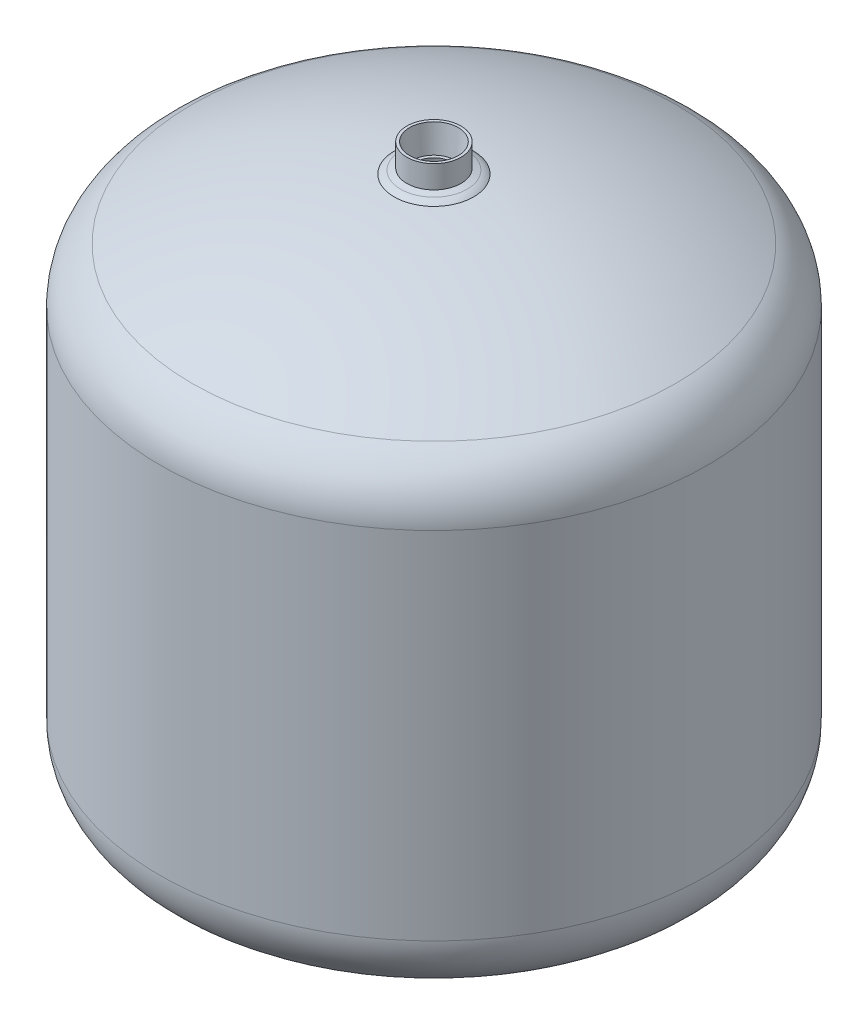
ISO-10303-21;
HEADER;
FILE_DESCRIPTION(('STEP AP214'),'2;1');
FILE_NAME('part.step','',(''),(''),'','','');
FILE_SCHEMA(('AUTOMOTIVE_DESIGN { 1 0 10303 214 1 1 1 1 }'));
ENDSEC;
DATA;
#1=APPLICATION_CONTEXT('core data for automotive mechanical design processes');
#2=APPLICATION_PROTOCOL_DEFINITION('international standard','automotive_design',2000,#1);
#3=PRODUCT_CONTEXT('',#1,'mechanical');
#4=PRODUCT('Part','Part','',(#3));
#5=PRODUCT_RELATED_PRODUCT_CATEGORY('part','',(#4));
#6=PRODUCT_DEFINITION_FORMATION('','',#4);
#7=PRODUCT_DEFINITION_CONTEXT('part definition',#1,'design');
#8=PRODUCT_DEFINITION('design','',#6,#7);
#9=PRODUCT_DEFINITION_SHAPE('','',#8);
#10=(LENGTH_UNIT() NAMED_UNIT(*) SI_UNIT(.MILLI.,.METRE.));
#11=(NAMED_UNIT(*) PLANE_ANGLE_UNIT() SI_UNIT($,.RADIAN.));
#12=(NAMED_UNIT(*) SI_UNIT($,.STERADIAN.) SOLID_ANGLE_UNIT());
#13=UNCERTAINTY_MEASURE_WITH_UNIT(LENGTH_MEASURE(1.E-05),#10,'distance_accuracy_value','');
#14=(GEOMETRIC_REPRESENTATION_CONTEXT(3) GLOBAL_UNCERTAINTY_ASSIGNED_CONTEXT((#13)) GLOBAL_UNIT_ASSIGNED_CONTEXT((#10,
#11,#12)) REPRESENTATION_CONTEXT('',''));
#15=CARTESIAN_POINT('',(0.,0.,0.));
#16=DIRECTION('',(0.,0.,1.));
#17=DIRECTION('',(1.,0.,0.));
#18=AXIS2_PLACEMENT_3D('',#15,#16,#17);
#19=CARTESIAN_POINT('',(0.,286.746527869373,0.));
#20=DIRECTION('',(1.,0.,0.));
#21=DIRECTION('',(0.,0.,-1.));
#22=AXIS2_PLACEMENT_3D('',#19,#20,#21);
#23=SPHERICAL_SURFACE('',#22,283.571527869373);
#24=CARTESIAN_POINT('',(0.,38.2925045868826,0.));
#25=DIRECTION('',(0.,1.,0.));
#26=DIRECTION('',(0.,0.,1.));
#27=AXIS2_PLACEMENT_3D('',#24,#25,#26);
#28=CIRCLE('',#27,136.687269827568);
#29=CARTESIAN_POINT('',(0.,38.2925045868826,136.687269827568));
#30=VERTEX_POINT('',#29);
#31=EDGE_CURVE('E19',#30,#30,#28,.T.);
#32=ORIENTED_EDGE('',*,*,#31,.T.);
#33=EDGE_LOOP('',(#32));
#34=FACE_BOUND('',#33,.T.);
#35=ADVANCED_FACE('F15',(#34),#23,.F.);
#36=CARTESIAN_POINT('',(0.,66.675,0.));
#37=DIRECTION('',(0.,1.,0.));
#38=DIRECTION('',(0.,0.,1.));
#39=AXIS2_PLACEMENT_3D('',#36,#37,#38);
#40=TOROIDAL_SURFACE('',#39,121.072606971006,32.3941930289939);
#41=ORIENTED_EDGE('',*,*,#31,.F.);
#42=EDGE_LOOP('',(#41));
#43=FACE_BOUND('',#42,.T.);
#44=CARTESIAN_POINT('',(0.,66.675,0.));
#45=DIRECTION('',(0.,1.,0.));
#46=DIRECTION('',(0.,0.,1.));
#47=AXIS2_PLACEMENT_3D('',#44,#45,#46);
#48=CIRCLE('',#47,153.4668);
#49=CARTESIAN_POINT('',(0.,66.675,153.4668));
#50=VERTEX_POINT('',#49);
#51=EDGE_CURVE('E98',#50,#50,#48,.T.);
#52=ORIENTED_EDGE('',*,*,#51,.T.);
#53=EDGE_LOOP('',(#52));
#54=FACE_BOUND('',#53,.T.);
#55=ADVANCED_FACE('F91',(#43,#54),#40,.F.);
#56=CARTESIAN_POINT('',(0.,-2.62081636125972,0.));
#57=DIRECTION('',(0.,1.,0.));
#58=DIRECTION('',(0.,0.,1.));
#59=AXIS2_PLACEMENT_3D('',#56,#57,#58);
#60=CYLINDRICAL_SURFACE('',#59,153.4668);
#61=ORIENTED_EDGE('',*,*,#51,.F.);
#62=EDGE_LOOP('',(#61));
#63=FACE_BOUND('',#62,.T.);
#64=CARTESIAN_POINT('',(0.,269.875,0.));
#65=DIRECTION('',(0.,1.,0.));
#66=DIRECTION('',(0.,0.,1.));
#67=AXIS2_PLACEMENT_3D('',#64,#65,#66);
#68=CIRCLE('',#67,153.4668);
#69=CARTESIAN_POINT('',(0.,269.875,153.4668));
#70=VERTEX_POINT('',#69);
#71=EDGE_CURVE('E126',#70,#70,#68,.T.);
#72=ORIENTED_EDGE('',*,*,#71,.T.);
#73=EDGE_LOOP('',(#72));
#74=FACE_BOUND('',#73,.T.);
#75=ADVANCED_FACE('F88',(#63,#74),#60,.F.);
#76=CARTESIAN_POINT('',(0.,269.875,0.));
#77=DIRECTION('',(0.,1.,0.));
#78=DIRECTION('',(0.,0.,1.));
#79=AXIS2_PLACEMENT_3D('',#76,#77,#78);
#80=TOROIDAL_SURFACE('',#79,121.072606971006,32.394193028994);
#81=ORIENTED_EDGE('',*,*,#71,.F.);
#82=EDGE_LOOP('',(#81));
#83=FACE_BOUND('',#82,.T.);
#84=CARTESIAN_POINT('',(0.,298.257495413117,0.));
#85=DIRECTION('',(0.,1.,0.));
#86=DIRECTION('',(0.,0.,1.));
#87=AXIS2_PLACEMENT_3D('',#84,#85,#86);
#88=CIRCLE('',#87,136.687269827568);
#89=CARTESIAN_POINT('',(0.,298.257495413117,136.687269827568));
#90=VERTEX_POINT('',#89);
#91=EDGE_CURVE('E124',#90,#90,#88,.T.);
#92=ORIENTED_EDGE('',*,*,#91,.T.);
#93=EDGE_LOOP('',(#92));
#94=FACE_BOUND('',#93,.T.);
#95=ADVANCED_FACE('F84',(#83,#94),#80,.F.);
#96=CARTESIAN_POINT('',(0.,49.8034721306266,0.));
#97=DIRECTION('',(1.,0.,0.));
#98=DIRECTION('',(0.,0.,-1.));
#99=AXIS2_PLACEMENT_3D('',#96,#97,#98);
#100=SPHERICAL_SURFACE('',#99,283.571527869373);
#101=ORIENTED_EDGE('',*,*,#91,.F.);
#102=EDGE_LOOP('',(#101));
#103=FACE_BOUND('',#102,.T.);
#104=CARTESIAN_POINT('',(0.,333.169693532206,0.));
#105=DIRECTION('',(0.,-1.,0.));
#106=DIRECTION('',(0.,0.,-1.));
#107=AXIS2_PLACEMENT_3D('',#104,#105,#106);
#108=CIRCLE('',#107,10.7886971762957);
#109=CARTESIAN_POINT('',(0.,333.169693532206,-10.7886971762957));
#110=VERTEX_POINT('',#109);
#111=EDGE_CURVE('E122',#110,#110,#108,.F.);
#112=ORIENTED_EDGE('',*,*,#111,.T.);
#113=EDGE_LOOP('',(#112));
#114=FACE_BOUND('',#113,.T.);
#115=ADVANCED_FACE('F81',(#103,#114),#100,.F.);
#116=CARTESIAN_POINT('',(0.,333.169693532206,0.));
#117=DIRECTION('',(0.,-1.,0.));
#118=DIRECTION('',(0.,0.,-1.));
#119=AXIS2_PLACEMENT_3D('',#116,#117,#118);
#120=CONICAL_SURFACE('',#119,10.7886971762957,0.117108744566864);
#121=ORIENTED_EDGE('',*,*,#111,.F.);
#122=EDGE_LOOP('',(#121));
#123=FACE_BOUND('',#122,.T.);
#124=CARTESIAN_POINT('',(0.,336.360857542227,0.));
#125=DIRECTION('',(0.,-1.,0.));
#126=DIRECTION('',(0.,0.,-1.));
#127=AXIS2_PLACEMENT_3D('',#124,#125,#126);
#128=CIRCLE('',#127,10.4132661162933);
#129=CARTESIAN_POINT('',(0.,336.360857542227,-10.4132661162933));
#130=VERTEX_POINT('',#129);
#131=EDGE_CURVE('E119',#130,#130,#128,.T.);
#132=ORIENTED_EDGE('',*,*,#131,.F.);
#133=EDGE_LOOP('',(#132));
#134=FACE_BOUND('',#133,.T.);
#135=ADVANCED_FACE('F70',(#123,#134),#120,.F.);
#136=CARTESIAN_POINT('',(0.,49.8034721306266,0.));
#137=DIRECTION('',(1.,0.,0.));
#138=DIRECTION('',(0.,0.,-1.));
#139=AXIS2_PLACEMENT_3D('',#136,#137,#138);
#140=SPHERICAL_SURFACE('',#139,286.746527869373);
#141=CARTESIAN_POINT('',(0.,336.285839897428,0.));
#142=DIRECTION('',(0.,1.,0.));
#143=DIRECTION('',(0.,0.,1.));
#144=AXIS2_PLACEMENT_3D('',#141,#142,#143);
#145=CIRCLE('',#144,12.3054542325063);
#146=CARTESIAN_POINT('',(0.,336.285839897428,12.3054542325063));
#147=VERTEX_POINT('',#146);
#148=EDGE_CURVE('E116',#147,#147,#145,.T.);
#149=ORIENTED_EDGE('',*,*,#148,.T.);
#150=EDGE_LOOP('',(#149));
#151=FACE_BOUND('',#150,.T.);
#152=ORIENTED_EDGE('',*,*,#131,.T.);
#153=EDGE_LOOP('',(#152));
#154=FACE_BOUND('',#153,.T.);
#155=ADVANCED_FACE('F65',(#151,#154),#140,.T.);
#156=CARTESIAN_POINT('',(0.,351.713114184006,0.));
#157=DIRECTION('',(0.,1.,0.));
#158=DIRECTION('',(0.,0.,1.));
#159=AXIS2_PLACEMENT_3D('',#156,#157,#158);
#160=CONICAL_SURFACE('',#159,13.901576930891,0.103094292414105);
#161=CARTESIAN_POINT('',(0.,351.713114184006,0.));
#162=DIRECTION('',(0.,1.,0.));
#163=DIRECTION('',(0.,0.,1.));
#164=AXIS2_PLACEMENT_3D('',#161,#162,#163);
#165=CIRCLE('',#164,13.901576930891);
#166=CARTESIAN_POINT('',(0.,351.713114184006,13.901576930891));
#167=VERTEX_POINT('',#166);
#168=EDGE_CURVE('E113',#167,#167,#165,.T.);
#169=ORIENTED_EDGE('',*,*,#168,.T.);
#170=EDGE_LOOP('',(#169));
#171=FACE_BOUND('',#170,.T.);
#172=ORIENTED_EDGE('',*,*,#148,.F.);
#173=EDGE_LOOP('',(#172));
#174=FACE_BOUND('',#173,.T.);
#175=ADVANCED_FACE('F61',(#171,#174),#160,.F.);
#176=CARTESIAN_POINT('',(13.901576930891,351.713114184006,0.));
#177=DIRECTION('',(0.,-1.,0.));
#178=DIRECTION('',(0.,0.,-1.));
#179=AXIS2_PLACEMENT_3D('',#176,#177,#178);
#180=PLANE('',#179);
#181=ORIENTED_EDGE('',*,*,#168,.F.);
#182=EDGE_LOOP('',(#181));
#183=FACE_BOUND('',#182,.T.);
#184=CARTESIAN_POINT('',(0.,351.713114184006,0.));
#185=DIRECTION('',(0.,-1.,0.));
#186=DIRECTION('',(0.,0.,-1.));
#187=AXIS2_PLACEMENT_3D('',#184,#185,#186);
#188=CIRCLE('',#187,15.4784256952821);
#189=CARTESIAN_POINT('',(0.,351.713114184006,-15.4784256952821));
#190=VERTEX_POINT('',#189);
#191=EDGE_CURVE('E110',#190,#190,#188,.T.);
#192=ORIENTED_EDGE('',*,*,#191,.F.);
#193=EDGE_LOOP('',(#192));
#194=FACE_BOUND('',#193,.T.);
#195=ADVANCED_FACE('F57',(#183,#194),#180,.F.);
#196=CARTESIAN_POINT('',(0.,0.,0.));
#197=DIRECTION('',(0.,-1.,0.));
#198=DIRECTION('',(0.,0.,-1.));
#199=AXIS2_PLACEMENT_3D('',#196,#197,#198);
#200=CYLINDRICAL_SURFACE('',#199,15.4784256952821);
#201=CARTESIAN_POINT('',(0.,338.712891318141,0.));
#202=DIRECTION('',(0.,-1.,0.));
#203=DIRECTION('',(0.,0.,-1.));
#204=AXIS2_PLACEMENT_3D('',#201,#202,#203);
#205=CIRCLE('',#204,15.4784256952821);
#206=CARTESIAN_POINT('',(0.,338.712891318141,-15.4784256952821));
#207=VERTEX_POINT('',#206);
#208=EDGE_CURVE('E76',#207,#207,#205,.T.);
#209=ORIENTED_EDGE('',*,*,#208,.F.);
#210=EDGE_LOOP('',(#209));
#211=FACE_BOUND('',#210,.T.);
#212=ORIENTED_EDGE('',*,*,#191,.T.);
#213=EDGE_LOOP('',(#212));
#214=FACE_BOUND('',#213,.T.);
#215=ADVANCED_FACE('F53',(#211,#214),#200,.T.);
#216=CARTESIAN_POINT('',(0.,337.609586425231,0.));
#217=DIRECTION('',(0.,-1.,0.));
#218=DIRECTION('',(0.,0.,-1.));
#219=AXIS2_PLACEMENT_3D('',#216,#217,#218);
#220=CONICAL_SURFACE('',#219,18.982326373052,1.2657455442403);
#221=CARTESIAN_POINT('',(0.,337.609586425231,0.));
#222=DIRECTION('',(0.,-1.,0.));
#223=DIRECTION('',(0.,0.,-1.));
#224=AXIS2_PLACEMENT_3D('',#221,#222,#223);
#225=CIRCLE('',#224,18.982326373052);
#226=CARTESIAN_POINT('',(0.,337.609586425231,-18.982326373052));
#227=VERTEX_POINT('',#226);
#228=EDGE_CURVE('E109',#227,#227,#225,.T.);
#229=ORIENTED_EDGE('',*,*,#228,.F.);
#230=EDGE_LOOP('',(#229));
#231=FACE_BOUND('',#230,.T.);
#232=ORIENTED_EDGE('',*,*,#208,.T.);
#233=EDGE_LOOP('',(#232));
#234=FACE_BOUND('',#233,.T.);
#235=ADVANCED_FACE('F49',(#231,#234),#220,.T.);
#236=CARTESIAN_POINT('',(0.,326.481819260806,0.));
#237=DIRECTION('',(0.,-1.,0.));
#238=DIRECTION('',(0.,0.,-1.));
#239=AXIS2_PLACEMENT_3D('',#236,#237,#238);
#240=TOROIDAL_SURFACE('',#239,15.4784256952821,11.6663842738588);
#241=CARTESIAN_POINT('',(0.,335.650710013993,0.));
#242=DIRECTION('',(0.,-1.,0.));
#243=DIRECTION('',(0.,0.,-1.));
#244=AXIS2_PLACEMENT_3D('',#241,#242,#243);
#245=CIRCLE('',#244,22.6920214963695);
#246=CARTESIAN_POINT('',(0.,335.650710013993,-22.6920214963695));
#247=VERTEX_POINT('',#246);
#248=EDGE_CURVE('E106',#247,#247,#245,.T.);
#249=ORIENTED_EDGE('',*,*,#248,.F.);
#250=EDGE_LOOP('',(#249));
#251=FACE_BOUND('',#250,.T.);
#252=ORIENTED_EDGE('',*,*,#228,.T.);
#253=EDGE_LOOP('',(#252));
#254=FACE_BOUND('',#253,.T.);
#255=ADVANCED_FACE('F44',(#251,#254),#240,.T.);
#256=CARTESIAN_POINT('',(0.,49.8034721306266,0.));
#257=DIRECTION('',(1.,0.,0.));
#258=DIRECTION('',(0.,0.,-1.));
#259=AXIS2_PLACEMENT_3D('',#256,#257,#258);
#260=SPHERICAL_SURFACE('',#259,286.746527869373);
#261=ORIENTED_EDGE('',*,*,#248,.T.);
#262=EDGE_LOOP('',(#261));
#263=FACE_BOUND('',#262,.T.);
#264=CARTESIAN_POINT('',(0.,301.039303339494,0.));
#265=DIRECTION('',(0.,-1.,0.));
#266=DIRECTION('',(0.,0.,-1.));
#267=AXIS2_PLACEMENT_3D('',#264,#265,#266);
#268=CIRCLE('',#267,138.217684693134);
#269=CARTESIAN_POINT('',(0.,301.039303339494,-138.217684693134));
#270=VERTEX_POINT('',#269);
#271=EDGE_CURVE('E103',#270,#270,#268,.T.);
#272=ORIENTED_EDGE('',*,*,#271,.F.);
#273=EDGE_LOOP('',(#272));
#274=FACE_BOUND('',#273,.T.);
#275=ADVANCED_FACE('F39',(#263,#274),#260,.T.);
#276=CARTESIAN_POINT('',(0.,286.746527869373,0.));
#277=DIRECTION('',(1.,0.,0.));
#278=DIRECTION('',(0.,0.,-1.));
#279=AXIS2_PLACEMENT_3D('',#276,#277,#278);
#280=SPHERICAL_SURFACE('',#279,286.746527869373);
#281=CARTESIAN_POINT('',(0.,35.5106966605055,0.));
#282=DIRECTION('',(0.,-1.,0.));
#283=DIRECTION('',(0.,0.,-1.));
#284=AXIS2_PLACEMENT_3D('',#281,#282,#283);
#285=CIRCLE('',#284,138.217684693134);
#286=CARTESIAN_POINT('',(0.,35.5106966605055,-138.217684693134));
#287=VERTEX_POINT('',#286);
#288=EDGE_CURVE('E28',#287,#287,#285,.F.);
#289=ORIENTED_EDGE('',*,*,#288,.F.);
#290=EDGE_LOOP('',(#289));
#291=FACE_BOUND('',#290,.T.);
#292=ADVANCED_FACE('F43',(#291),#280,.T.);
#293=CARTESIAN_POINT('',(0.,269.875,0.));
#294=DIRECTION('',(0.,-1.,0.));
#295=DIRECTION('',(0.,0.,-1.));
#296=AXIS2_PLACEMENT_3D('',#293,#294,#295);
#297=TOROIDAL_SURFACE('',#296,121.072606971006,35.5691930289939);
#298=CARTESIAN_POINT('',(0.,269.875,0.));
#299=DIRECTION('',(0.,-1.,0.));
#300=DIRECTION('',(0.,0.,-1.));
#301=AXIS2_PLACEMENT_3D('',#298,#299,#300);
#302=CIRCLE('',#301,156.6418);
#303=CARTESIAN_POINT('',(0.,269.875,-156.6418));
#304=VERTEX_POINT('',#303);
#305=EDGE_CURVE('E23',#304,#304,#302,.T.);
#306=ORIENTED_EDGE('',*,*,#305,.F.);
#307=EDGE_LOOP('',(#306));
#308=FACE_BOUND('',#307,.T.);
#309=ORIENTED_EDGE('',*,*,#271,.T.);
#310=EDGE_LOOP('',(#309));
#311=FACE_BOUND('',#310,.T.);
#312=ADVANCED_FACE('F149',(#308,#311),#297,.T.);
#313=CARTESIAN_POINT('',(0.,66.675,0.));
#314=DIRECTION('',(0.,-1.,0.));
#315=DIRECTION('',(0.,0.,-1.));
#316=AXIS2_PLACEMENT_3D('',#313,#314,#315);
#317=TOROIDAL_SURFACE('',#316,121.072606971006,35.5691930289939);
#318=ORIENTED_EDGE('',*,*,#288,.T.);
#319=EDGE_LOOP('',(#318));
#320=FACE_BOUND('',#319,.T.);
#321=CARTESIAN_POINT('',(0.,66.675,0.));
#322=DIRECTION('',(0.,-1.,0.));
#323=DIRECTION('',(0.,0.,-1.));
#324=AXIS2_PLACEMENT_3D('',#321,#322,#323);
#325=CIRCLE('',#324,156.6418);
#326=CARTESIAN_POINT('',(0.,66.675,-156.6418));
#327=VERTEX_POINT('',#326);
#328=EDGE_CURVE('E10',#327,#327,#325,.F.);
#329=ORIENTED_EDGE('',*,*,#328,.F.);
#330=EDGE_LOOP('',(#329));
#331=FACE_BOUND('',#330,.T.);
#332=ADVANCED_FACE('F144',(#320,#331),#317,.T.);
#333=CARTESIAN_POINT('',(0.,0.,0.));
#334=DIRECTION('',(0.,-1.,0.));
#335=DIRECTION('',(0.,0.,-1.));
#336=AXIS2_PLACEMENT_3D('',#333,#334,#335);
#337=CYLINDRICAL_SURFACE('',#336,156.6418);
#338=ORIENTED_EDGE('',*,*,#328,.T.);
#339=EDGE_LOOP('',(#338));
#340=FACE_BOUND('',#339,.T.);
#341=ORIENTED_EDGE('',*,*,#305,.T.);
#342=EDGE_LOOP('',(#341));
#343=FACE_BOUND('',#342,.T.);
#344=ADVANCED_FACE('F142',(#340,#343),#337,.T.);
#345=CLOSED_SHELL('',(#35,#55,#75,#95,#115,#135,#155,#175,#195,#215,#235,#255,#275,#292,#312,
#332,#344));
#346=MANIFOLD_SOLID_BREP('B1',#345);
#347=ADVANCED_BREP_SHAPE_REPRESENTATION('',(#18,#346),#14);
#348=SHAPE_DEFINITION_REPRESENTATION(#9,#347);
ENDSEC;
END-ISO-10303-21;
